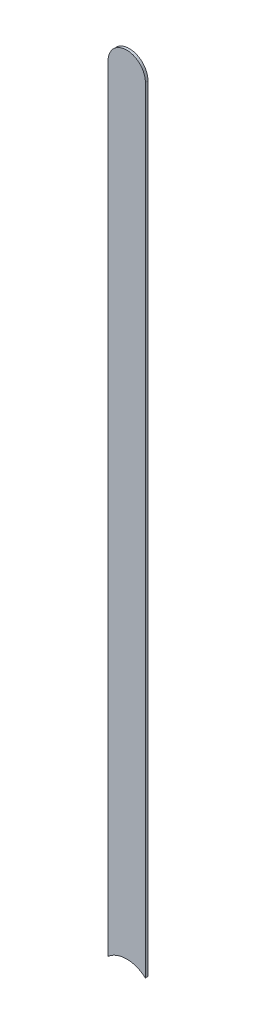
ISO-10303-21;
HEADER;
FILE_DESCRIPTION(('STEP AP214'),'2;1');
FILE_NAME('part.step','',(''),(''),'','','');
FILE_SCHEMA(('AUTOMOTIVE_DESIGN { 1 0 10303 214 1 1 1 1 }'));
ENDSEC;
DATA;
#1=APPLICATION_CONTEXT('core data for automotive mechanical design processes');
#2=APPLICATION_PROTOCOL_DEFINITION('international standard','automotive_design',2000,#1);
#3=PRODUCT_CONTEXT('',#1,'mechanical');
#4=PRODUCT('Part','Part','',(#3));
#5=PRODUCT_RELATED_PRODUCT_CATEGORY('part','',(#4));
#6=PRODUCT_DEFINITION_FORMATION('','',#4);
#7=PRODUCT_DEFINITION_CONTEXT('part definition',#1,'design');
#8=PRODUCT_DEFINITION('design','',#6,#7);
#9=PRODUCT_DEFINITION_SHAPE('','',#8);
#10=(LENGTH_UNIT() NAMED_UNIT(*) SI_UNIT(.MILLI.,.METRE.));
#11=(NAMED_UNIT(*) PLANE_ANGLE_UNIT() SI_UNIT($,.RADIAN.));
#12=(NAMED_UNIT(*) SI_UNIT($,.STERADIAN.) SOLID_ANGLE_UNIT());
#13=UNCERTAINTY_MEASURE_WITH_UNIT(LENGTH_MEASURE(1.E-05),#10,'distance_accuracy_value','');
#14=(GEOMETRIC_REPRESENTATION_CONTEXT(3) GLOBAL_UNCERTAINTY_ASSIGNED_CONTEXT((#13)) GLOBAL_UNIT_ASSIGNED_CONTEXT((#10,
#11,#12)) REPRESENTATION_CONTEXT('',''));
#15=CARTESIAN_POINT('',(0.,0.,0.));
#16=DIRECTION('',(0.,0.,1.));
#17=DIRECTION('',(1.,0.,0.));
#18=AXIS2_PLACEMENT_3D('',#15,#16,#17);
#19=CARTESIAN_POINT('',(172.978,-91.948,-0.035));
#20=DIRECTION('',(1.,0.,0.));
#21=DIRECTION('',(0.,1.,0.));
#22=AXIS2_PLACEMENT_3D('',#19,#20,#21);
#23=PLANE('',#22);
#24=DIRECTION('',(0.,0.,-1.));
#25=VECTOR('',#24,1.);
#26=CARTESIAN_POINT('',(172.978,-102.3364915028,-0.045));
#27=LINE('',#26,#25);
#28=CARTESIAN_POINT('',(172.978,-102.3364915028,0.));
#29=VERTEX_POINT('',#28);
#30=CARTESIAN_POINT('',(172.978,-102.3364915028,-0.035));
#31=VERTEX_POINT('',#30);
#32=EDGE_CURVE('E11',#29,#31,#27,.T.);
#33=ORIENTED_EDGE('',*,*,#32,.F.);
#34=DIRECTION('',(0.,-1.,0.));
#35=VECTOR('',#34,1.);
#36=CARTESIAN_POINT('',(172.978,-91.948,0.));
#37=LINE('',#36,#35);
#38=CARTESIAN_POINT('',(172.978,-91.948,0.));
#39=VERTEX_POINT('',#38);
#40=EDGE_CURVE('E26',#39,#29,#37,.T.);
#41=ORIENTED_EDGE('',*,*,#40,.F.);
#42=DIRECTION('',(0.,0.,1.));
#43=VECTOR('',#42,1.);
#44=CARTESIAN_POINT('',(172.978,-91.948,-0.035));
#45=LINE('',#44,#43);
#46=CARTESIAN_POINT('',(172.978,-91.948,-0.035));
#47=VERTEX_POINT('',#46);
#48=EDGE_CURVE('E107',#47,#39,#45,.T.);
#49=ORIENTED_EDGE('',*,*,#48,.F.);
#50=DIRECTION('',(0.,-1.,0.));
#51=VECTOR('',#50,1.);
#52=CARTESIAN_POINT('',(172.978,-91.948,-0.035));
#53=LINE('',#52,#51);
#54=EDGE_CURVE('E75',#47,#31,#53,.T.);
#55=ORIENTED_EDGE('',*,*,#54,.T.);
#56=EDGE_LOOP('',(#33,#41,#49,#55));
#57=FACE_BOUND('',#56,.T.);
#58=ADVANCED_FACE('F17',(#57),#23,.F.);
#59=CARTESIAN_POINT('',(173.228,-102.616,-0.045));
#60=DIRECTION('',(0.,0.,-1.));
#61=DIRECTION('',(0.,-1.,0.));
#62=AXIS2_PLACEMENT_3D('',#59,#60,#61);
#63=CYLINDRICAL_SURFACE('',#62,0.375);
#64=DIRECTION('',(0.,0.,-1.));
#65=VECTOR('',#64,1.);
#66=CARTESIAN_POINT('',(173.478,-102.3364915028,-0.045));
#67=LINE('',#66,#65);
#68=CARTESIAN_POINT('',(173.478,-102.3364915028,0.));
#69=VERTEX_POINT('',#68);
#70=CARTESIAN_POINT('',(173.478,-102.3364915028,-0.035));
#71=VERTEX_POINT('',#70);
#72=EDGE_CURVE('E88',#69,#71,#67,.T.);
#73=ORIENTED_EDGE('',*,*,#72,.F.);
#74=CARTESIAN_POINT('',(173.228,-102.616,0.));
#75=DIRECTION('',(0.,0.,-1.));
#76=DIRECTION('',(0.,-1.,0.));
#77=AXIS2_PLACEMENT_3D('',#74,#75,#76);
#78=CIRCLE('',#77,0.375);
#79=EDGE_CURVE('E20',#29,#69,#78,.T.);
#80=ORIENTED_EDGE('',*,*,#79,.F.);
#81=ORIENTED_EDGE('',*,*,#32,.T.);
#82=CARTESIAN_POINT('',(173.228,-102.616,-0.035));
#83=DIRECTION('',(0.,0.,-1.));
#84=DIRECTION('',(0.,-1.,0.));
#85=AXIS2_PLACEMENT_3D('',#82,#83,#84);
#86=CIRCLE('',#85,0.375);
#87=EDGE_CURVE('E80',#31,#71,#86,.T.);
#88=ORIENTED_EDGE('',*,*,#87,.T.);
#89=EDGE_LOOP('',(#73,#80,#81,#88));
#90=FACE_BOUND('',#89,.T.);
#91=ADVANCED_FACE('F123',(#90),#63,.F.);
#92=CARTESIAN_POINT('',(173.478,-102.616,0.));
#93=DIRECTION('',(0.,0.,1.));
#94=DIRECTION('',(1.,0.,0.));
#95=AXIS2_PLACEMENT_3D('',#92,#93,#94);
#96=PLANE('',#95);
#97=ORIENTED_EDGE('',*,*,#79,.T.);
#98=DIRECTION('',(0.,1.,0.));
#99=VECTOR('',#98,1.);
#100=CARTESIAN_POINT('',(173.478,-102.616,0.));
#101=LINE('',#100,#99);
#102=CARTESIAN_POINT('',(173.478,-91.948,0.));
#103=VERTEX_POINT('',#102);
#104=EDGE_CURVE('E95',#69,#103,#101,.T.);
#105=ORIENTED_EDGE('',*,*,#104,.T.);
#106=CARTESIAN_POINT('',(173.228,-91.948,0.));
#107=DIRECTION('',(0.,0.,1.));
#108=DIRECTION('',(1.,0.,0.));
#109=AXIS2_PLACEMENT_3D('',#106,#107,#108);
#110=CIRCLE('',#109,0.25);
#111=EDGE_CURVE('E92',#103,#39,#110,.T.);
#112=ORIENTED_EDGE('',*,*,#111,.T.);
#113=ORIENTED_EDGE('',*,*,#40,.T.);
#114=EDGE_LOOP('',(#97,#105,#112,#113));
#115=FACE_BOUND('',#114,.T.);
#116=ADVANCED_FACE('F121',(#115),#96,.T.);
#117=CARTESIAN_POINT('',(173.228,-91.948,-0.035));
#118=DIRECTION('',(0.,0.,-1.));
#119=DIRECTION('',(1.,0.,0.));
#120=AXIS2_PLACEMENT_3D('',#117,#118,#119);
#121=CYLINDRICAL_SURFACE('',#120,0.25);
#122=CARTESIAN_POINT('',(173.228,-91.948,-0.035));
#123=DIRECTION('',(0.,0.,1.));
#124=DIRECTION('',(1.,0.,0.));
#125=AXIS2_PLACEMENT_3D('',#122,#123,#124);
#126=CIRCLE('',#125,0.25);
#127=CARTESIAN_POINT('',(173.478,-91.948,-0.035));
#128=VERTEX_POINT('',#127);
#129=EDGE_CURVE('E69',#128,#47,#126,.T.);
#130=ORIENTED_EDGE('',*,*,#129,.T.);
#131=ORIENTED_EDGE('',*,*,#48,.T.);
#132=ORIENTED_EDGE('',*,*,#111,.F.);
#133=DIRECTION('',(0.,0.,1.));
#134=VECTOR('',#133,1.);
#135=CARTESIAN_POINT('',(173.478,-91.948,-0.035));
#136=LINE('',#135,#134);
#137=EDGE_CURVE('E86',#128,#103,#136,.T.);
#138=ORIENTED_EDGE('',*,*,#137,.F.);
#139=EDGE_LOOP('',(#130,#131,#132,#138));
#140=FACE_BOUND('',#139,.T.);
#141=ADVANCED_FACE('F91',(#140),#121,.T.);
#142=CARTESIAN_POINT('',(173.478,-102.616,-0.035));
#143=DIRECTION('',(0.,0.,1.));
#144=DIRECTION('',(1.,0.,0.));
#145=AXIS2_PLACEMENT_3D('',#142,#143,#144);
#146=PLANE('',#145);
#147=ORIENTED_EDGE('',*,*,#54,.F.);
#148=ORIENTED_EDGE('',*,*,#129,.F.);
#149=DIRECTION('',(0.,1.,0.));
#150=VECTOR('',#149,1.);
#151=CARTESIAN_POINT('',(173.478,-102.616,-0.035));
#152=LINE('',#151,#150);
#153=EDGE_CURVE('E73',#71,#128,#152,.T.);
#154=ORIENTED_EDGE('',*,*,#153,.F.);
#155=ORIENTED_EDGE('',*,*,#87,.F.);
#156=EDGE_LOOP('',(#147,#148,#154,#155));
#157=FACE_BOUND('',#156,.T.);
#158=ADVANCED_FACE('F71',(#157),#146,.F.);
#159=CARTESIAN_POINT('',(173.478,-102.616,-0.035));
#160=DIRECTION('',(-1.,0.,0.));
#161=DIRECTION('',(0.,0.,1.));
#162=AXIS2_PLACEMENT_3D('',#159,#160,#161);
#163=PLANE('',#162);
#164=ORIENTED_EDGE('',*,*,#137,.T.);
#165=ORIENTED_EDGE('',*,*,#104,.F.);
#166=ORIENTED_EDGE('',*,*,#72,.T.);
#167=ORIENTED_EDGE('',*,*,#153,.T.);
#168=EDGE_LOOP('',(#164,#165,#166,#167));
#169=FACE_BOUND('',#168,.T.);
#170=ADVANCED_FACE('F84',(#169),#163,.F.);
#171=CLOSED_SHELL('',(#58,#91,#116,#141,#158,#170));
#172=MANIFOLD_SOLID_BREP('B1',#171);
#173=ADVANCED_BREP_SHAPE_REPRESENTATION('',(#18,#172),#14);
#174=SHAPE_DEFINITION_REPRESENTATION(#9,#173);
ENDSEC;
END-ISO-10303-21;
